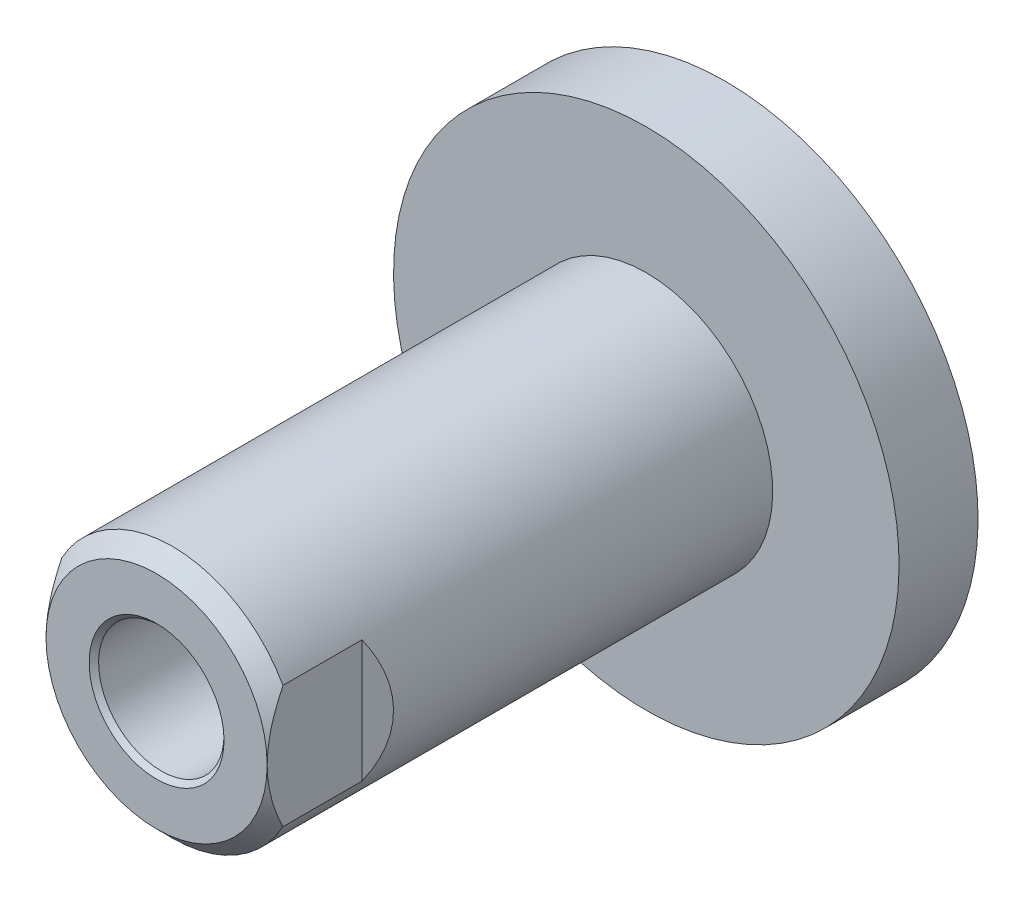
ISO-10303-21;
HEADER;
FILE_DESCRIPTION(('STEP AP214'),'2;1');
FILE_NAME('part.step','',(''),(''),'','','');
FILE_SCHEMA(('AUTOMOTIVE_DESIGN { 1 0 10303 214 1 1 1 1 }'));
ENDSEC;
DATA;
#1=APPLICATION_CONTEXT('core data for automotive mechanical design processes');
#2=APPLICATION_PROTOCOL_DEFINITION('international standard','automotive_design',2000,#1);
#3=PRODUCT_CONTEXT('',#1,'mechanical');
#4=PRODUCT('Part','Part','',(#3));
#5=PRODUCT_RELATED_PRODUCT_CATEGORY('part','',(#4));
#6=PRODUCT_DEFINITION_FORMATION('','',#4);
#7=PRODUCT_DEFINITION_CONTEXT('part definition',#1,'design');
#8=PRODUCT_DEFINITION('design','',#6,#7);
#9=PRODUCT_DEFINITION_SHAPE('','',#8);
#10=(LENGTH_UNIT() NAMED_UNIT(*) SI_UNIT(.MILLI.,.METRE.));
#11=(NAMED_UNIT(*) PLANE_ANGLE_UNIT() SI_UNIT($,.RADIAN.));
#12=(NAMED_UNIT(*) SI_UNIT($,.STERADIAN.) SOLID_ANGLE_UNIT());
#13=UNCERTAINTY_MEASURE_WITH_UNIT(LENGTH_MEASURE(1.E-05),#10,'distance_accuracy_value','');
#14=(GEOMETRIC_REPRESENTATION_CONTEXT(3) GLOBAL_UNCERTAINTY_ASSIGNED_CONTEXT((#13)) GLOBAL_UNIT_ASSIGNED_CONTEXT((#10,
#11,#12)) REPRESENTATION_CONTEXT('',''));
#15=CARTESIAN_POINT('',(0.,0.,0.));
#16=DIRECTION('',(0.,0.,1.));
#17=DIRECTION('',(1.,0.,0.));
#18=AXIS2_PLACEMENT_3D('',#15,#16,#17);
#19=CARTESIAN_POINT('',(0.,0.,23.));
#20=DIRECTION('',(0.,0.,1.));
#21=DIRECTION('',(0.,-1.,0.));
#22=AXIS2_PLACEMENT_3D('',#19,#20,#21);
#23=PLANE('',#22);
#24=CARTESIAN_POINT('',(0.,0.,23.));
#25=DIRECTION('',(0.,0.,1.));
#26=DIRECTION('',(0.,-1.,0.));
#27=AXIS2_PLACEMENT_3D('',#24,#25,#26);
#28=CIRCLE('',#27,3.97);
#29=CARTESIAN_POINT('',(0.,-3.97000000000006,23.));
#30=VERTEX_POINT('',#29);
#31=EDGE_CURVE('E21',#30,#30,#28,.T.);
#32=ORIENTED_EDGE('',*,*,#31,.T.);
#33=EDGE_LOOP('',(#32));
#34=FACE_BOUND('',#33,.T.);
#35=ADVANCED_FACE('F18',(#34),#23,.T.);
#36=CARTESIAN_POINT('',(0.,0.,23.));
#37=DIRECTION('',(0.,0.,1.));
#38=DIRECTION('',(0.,-1.,0.));
#39=AXIS2_PLACEMENT_3D('',#36,#37,#38);
#40=CYLINDRICAL_SURFACE('',#39,3.97);
#41=ORIENTED_EDGE('',*,*,#31,.F.);
#42=EDGE_LOOP('',(#41));
#43=FACE_BOUND('',#42,.T.);
#44=CARTESIAN_POINT('',(0.,0.,35.7000000000198));
#45=DIRECTION('',(0.,0.,1.));
#46=DIRECTION('',(1.,0.,0.));
#47=AXIS2_PLACEMENT_3D('',#44,#45,#46);
#48=CIRCLE('',#47,3.96999999998116);
#49=CARTESIAN_POINT('',(3.96999999998116,0.,35.7000000000198));
#50=VERTEX_POINT('',#49);
#51=EDGE_CURVE('E129',#50,#50,#48,.T.);
#52=ORIENTED_EDGE('',*,*,#51,.T.);
#53=EDGE_LOOP('',(#52));
#54=FACE_BOUND('',#53,.T.);
#55=ADVANCED_FACE('F232',(#43,#54),#40,.F.);
#56=CARTESIAN_POINT('',(0.,0.,36.0000000000582));
#57=DIRECTION('',(0.,0.,1.));
#58=DIRECTION('',(1.,0.,0.));
#59=AXIS2_PLACEMENT_3D('',#56,#57,#58);
#60=CONICAL_SURFACE('',#59,4.27000000001954,0.785398163397448);
#61=ORIENTED_EDGE('',*,*,#51,.F.);
#62=EDGE_LOOP('',(#61));
#63=FACE_BOUND('',#62,.T.);
#64=CARTESIAN_POINT('',(0.,0.,36.0000000000582));
#65=DIRECTION('',(0.,0.,1.));
#66=DIRECTION('',(1.,0.,0.));
#67=AXIS2_PLACEMENT_3D('',#64,#65,#66);
#68=CIRCLE('',#67,4.27000000001954);
#69=CARTESIAN_POINT('',(4.27000000001954,0.,36.0000000000582));
#70=VERTEX_POINT('',#69);
#71=EDGE_CURVE('E71',#70,#70,#68,.F.);
#72=ORIENTED_EDGE('',*,*,#71,.F.);
#73=EDGE_LOOP('',(#72));
#74=FACE_BOUND('',#73,.T.);
#75=ADVANCED_FACE('F227',(#63,#74),#60,.F.);
#76=CARTESIAN_POINT('',(0.,0.,36.));
#77=DIRECTION('',(0.,0.,1.));
#78=DIRECTION('',(0.,-1.,0.));
#79=AXIS2_PLACEMENT_3D('',#76,#77,#78);
#80=PLANE('',#79);
#81=CARTESIAN_POINT('',(0.,0.,35.9999999999445));
#82=DIRECTION('',(0.,0.,-1.));
#83=DIRECTION('',(-1.,0.,0.));
#84=AXIS2_PLACEMENT_3D('',#81,#82,#83);
#85=CIRCLE('',#84,7.000000000005);
#86=CARTESIAN_POINT('',(-7.0000000000025,0.,35.999999999947));
#87=VERTEX_POINT('',#86);
#88=CARTESIAN_POINT('',(7.0000000000025,0.,35.999999999947));
#89=VERTEX_POINT('',#88);
#90=EDGE_CURVE('E55',#87,#89,#85,.T.);
#91=ORIENTED_EDGE('',*,*,#90,.F.);
#92=CARTESIAN_POINT('',(0.,0.,35.9999999999445));
#93=DIRECTION('',(0.,0.,-1.));
#94=DIRECTION('',(-1.,0.,0.));
#95=AXIS2_PLACEMENT_3D('',#92,#93,#94);
#96=CIRCLE('',#95,7.000000000005);
#97=EDGE_CURVE('E62',#89,#87,#96,.T.);
#98=ORIENTED_EDGE('',*,*,#97,.F.);
#99=EDGE_LOOP('',(#91,#98));
#100=FACE_BOUND('',#99,.T.);
#101=ORIENTED_EDGE('',*,*,#71,.T.);
#102=EDGE_LOOP('',(#101));
#103=FACE_BOUND('',#102,.T.);
#104=ADVANCED_FACE('F85',(#100,#103),#80,.T.);
#105=CARTESIAN_POINT('',(0.,0.,34.9999999999113));
#106=DIRECTION('',(0.,0.,-1.));
#107=DIRECTION('',(-1.,0.,0.));
#108=AXIS2_PLACEMENT_3D('',#105,#106,#107);
#109=CONICAL_SURFACE('',#108,7.99999999998136,0.785398163369027);
#110=CARTESIAN_POINT('',(7.00000000002258,-3.87298334617018,34.9999999999229));
#111=CARTESIAN_POINT('',(7.00000000000832,-3.73806698883901,35.0653070851011));
#112=CARTESIAN_POINT('',(7.00000000000228,-3.60213206543072,35.1285128367506));
#113=CARTESIAN_POINT('',(6.99999999999772,-3.32804378738901,35.2501127896948));
#114=CARTESIAN_POINT('',(6.99999999999921,-3.18988928343521,35.3085043954999));
#115=CARTESIAN_POINT('',(7.0000000000016,-2.77056998576093,35.4760299007574));
#116=CARTESIAN_POINT('',(7.00000000000041,-2.48597423662735,35.576809700547));
#117=CARTESIAN_POINT('',(6.9999999999996,-1.91587318399986,35.747489678305));
#118=CARTESIAN_POINT('',(6.99999999999993,-1.63060403598947,35.8181565525033));
#119=CARTESIAN_POINT('',(7.00000000000004,-1.19849633042339,35.8995521238037));
#120=CARTESIAN_POINT('',(7.00000000000001,-1.05392230350616,35.9225712542843));
#121=CARTESIAN_POINT('',(6.99999999999999,-0.763672568750489,35.959934240698));
#122=CARTESIAN_POINT('',(7.,-0.617997201670231,35.974280677037));
#123=CARTESIAN_POINT('',(7.,-0.39361858739629,35.9893792300256));
#124=CARTESIAN_POINT('',(7.,-0.315119520849899,35.9933500116863));
#125=CARTESIAN_POINT('',(7.,-0.157749174233256,35.9986663831592));
#126=CARTESIAN_POINT('',(7.,-0.0788775728946304,36.0000024522742));
#127=CARTESIAN_POINT('',(7.,0.,35.9999999999495));
#128=B_SPLINE_CURVE_WITH_KNOTS('',3,(#110,#111,#112,#113,#114,#115,#116,#117,#118,#119,#120,
#121,#122,#123,#124,#125,#126,#127),.UNSPECIFIED.,.F.,.F.,(4,2,2,2,2,2,2,2,4),(0.,
0.449646435828888,0.899533729166914,1.80406503691855,2.68394566334976,3.1229141026453,
3.56175187032726,3.79751124506275,4.03412100107633),.UNSPECIFIED.);
#129=CARTESIAN_POINT('',(7.,-3.87298334618644,34.9999999999565));
#130=VERTEX_POINT('',#129);
#131=EDGE_CURVE('E68',#130,#89,#128,.T.);
#132=ORIENTED_EDGE('',*,*,#131,.T.);
#133=ORIENTED_EDGE('',*,*,#97,.T.);
#134=CARTESIAN_POINT('',(-7.,0.,35.9999999999495));
#135=CARTESIAN_POINT('',(-7.,-0.107485564999522,36.0000124763697));
#136=CARTESIAN_POINT('',(-7.,-0.214966878707483,35.9975246572284));
#137=CARTESIAN_POINT('',(-7.,-0.429687370649734,35.9876410915484));
#138=CARTESIAN_POINT('',(-7.,-0.536926584158774,35.9802461134674));
#139=CARTESIAN_POINT('',(-7.,-0.750779369921216,35.9606576631995));
#140=CARTESIAN_POINT('',(-7.,-0.857393700044826,35.9484724479857));
#141=CARTESIAN_POINT('',(-7.,-1.06998728716205,35.919478957683));
#142=CARTESIAN_POINT('',(-7.,-1.17596652687346,35.9026705573654));
#143=CARTESIAN_POINT('',(-7.,-1.48956425356986,35.8461907990338));
#144=CARTESIAN_POINT('',(-7.,-1.69606057694875,35.8001570553438));
#145=CARTESIAN_POINT('',(-7.,-2.10509003541976,35.6929912555384));
#146=CARTESIAN_POINT('',(-7.,-2.30762204307205,35.6318549697482));
#147=CARTESIAN_POINT('',(-7.,-2.62416262602529,35.5250915714674));
#148=CARTESIAN_POINT('',(-7.,-2.73963668219789,35.4837296498472));
#149=CARTESIAN_POINT('',(-7.,-2.96907795982693,35.3970963361359));
#150=CARTESIAN_POINT('',(-7.,-3.08304554606322,35.3518259112225));
#151=CARTESIAN_POINT('',(-7.,-3.31052645780854,35.25734038814));
#152=CARTESIAN_POINT('',(-7.,-3.42402653781661,35.2080935476885));
#153=CARTESIAN_POINT('',(-7.,-3.64958006836686,35.1063745702166));
#154=CARTESIAN_POINT('',(-7.,-3.76163345396354,35.0539022890036));
#155=CARTESIAN_POINT('',(-7.,-3.87298334616665,34.9999999999124));
#156=B_SPLINE_CURVE_WITH_KNOTS('',3,(#134,#135,#136,#137,#138,#139,#140,#141,#142,#143,#144,
#145,#146,#147,#148,#149,#150,#151,#152,#153,#154,#155),.UNSPECIFIED.,.F.,.F.,(4,2,2,2,2,2,2,2,
2,2,4),(0.,0.32242086339032,0.644791247799432,0.96660837903797,1.28843422822447,
1.92241990363746,2.55658333716694,2.9244936378832,3.29231315696484,3.66343214190586,
4.03456772972142),.UNSPECIFIED.);
#157=CARTESIAN_POINT('',(-7.,-3.87298334618644,34.9999999999565));
#158=VERTEX_POINT('',#157);
#159=EDGE_CURVE('E66',#87,#158,#156,.T.);
#160=ORIENTED_EDGE('',*,*,#159,.T.);
#161=CARTESIAN_POINT('',(0.,0.,35.));
#162=DIRECTION('',(0.,0.,-1.));
#163=DIRECTION('',(0.,1.,0.));
#164=AXIS2_PLACEMENT_3D('',#161,#162,#163);
#165=CIRCLE('',#164,8.);
#166=EDGE_CURVE('E132',#130,#158,#165,.T.);
#167=ORIENTED_EDGE('',*,*,#166,.F.);
#168=EDGE_LOOP('',(#132,#133,#160,#167));
#169=FACE_BOUND('',#168,.T.);
#170=ADVANCED_FACE('F64',(#169),#109,.T.);
#171=CARTESIAN_POINT('',(8.00000000000002,7.49999999999995,29.));
#172=DIRECTION('',(0.707106781186544,0.,0.707106781186551));
#173=DIRECTION('',(0.707106781186551,0.,-0.707106781186544));
#174=AXIS2_PLACEMENT_3D('',#171,#172,#173);
#175=PLANE('',#174);
#176=DIRECTION('',(0.,1.,0.));
#177=VECTOR('',#176,1.);
#178=CARTESIAN_POINT('',(7.,7.49999999999995,30.));
#179=LINE('',#178,#177);
#180=CARTESIAN_POINT('',(7.,3.87298334620737,30.));
#181=VERTEX_POINT('',#180);
#182=CARTESIAN_POINT('',(7.,-3.87298334620748,30.));
#183=VERTEX_POINT('',#182);
#184=EDGE_CURVE('E116',#181,#183,#179,.F.);
#185=ORIENTED_EDGE('',*,*,#184,.T.);
#186=CARTESIAN_POINT('',(0.,0.,36.9999999999999));
#187=DIRECTION('',(0.707106781186544,0.,0.707106781186551));
#188=DIRECTION('',(0.707106781186551,0.,-0.707106781186544));
#189=AXIS2_PLACEMENT_3D('',#186,#187,#188);
#190=ELLIPSE('',#189,11.3137084989847,8.);
#191=EDGE_CURVE('E117',#181,#183,#190,.F.);
#192=ORIENTED_EDGE('',*,*,#191,.F.);
#193=EDGE_LOOP('',(#185,#192));
#194=FACE_BOUND('',#193,.T.);
#195=ADVANCED_FACE('F152',(#194),#175,.T.);
#196=CARTESIAN_POINT('',(-8.00000000000002,7.49999999999995,29.));
#197=DIRECTION('',(0.707106781186544,0.,-0.707106781186551));
#198=DIRECTION('',(-0.707106781186551,0.,-0.707106781186544));
#199=AXIS2_PLACEMENT_3D('',#196,#197,#198);
#200=PLANE('',#199);
#201=DIRECTION('',(0.,1.,0.));
#202=VECTOR('',#201,1.);
#203=CARTESIAN_POINT('',(-7.,7.49999999999995,30.));
#204=LINE('',#203,#202);
#205=CARTESIAN_POINT('',(-7.,-3.87298334620746,30.));
#206=VERTEX_POINT('',#205);
#207=CARTESIAN_POINT('',(-7.,3.87298334620735,30.));
#208=VERTEX_POINT('',#207);
#209=EDGE_CURVE('E81',#206,#208,#204,.T.);
#210=ORIENTED_EDGE('',*,*,#209,.T.);
#211=CARTESIAN_POINT('',(0.,0.,36.9999999999999));
#212=DIRECTION('',(0.707106781186544,0.,-0.707106781186551));
#213=DIRECTION('',(-0.707106781186551,0.,-0.707106781186544));
#214=AXIS2_PLACEMENT_3D('',#211,#212,#213);
#215=ELLIPSE('',#214,11.3137084989847,8.);
#216=EDGE_CURVE('E119',#206,#208,#215,.T.);
#217=ORIENTED_EDGE('',*,*,#216,.F.);
#218=EDGE_LOOP('',(#210,#217));
#219=FACE_BOUND('',#218,.T.);
#220=ADVANCED_FACE('F157',(#219),#200,.F.);
#221=CARTESIAN_POINT('',(-7.,7.49999999999995,29.));
#222=DIRECTION('',(1.,0.,0.));
#223=DIRECTION('',(0.,0.,-1.));
#224=AXIS2_PLACEMENT_3D('',#221,#222,#223);
#225=PLANE('',#224);
#226=ORIENTED_EDGE('',*,*,#209,.F.);
#227=DIRECTION('',(0.,0.,-1.));
#228=VECTOR('',#227,1.);
#229=CARTESIAN_POINT('',(-7.,-3.87298334620748,58.6274169979695));
#230=LINE('',#229,#228);
#231=EDGE_CURVE('E80',#158,#206,#230,.T.);
#232=ORIENTED_EDGE('',*,*,#231,.F.);
#233=ORIENTED_EDGE('',*,*,#159,.F.);
#234=CARTESIAN_POINT('',(-7.,3.87298334617215,34.9999999999097));
#235=CARTESIAN_POINT('',(-7.,3.738066988844,35.0653070850943));
#236=CARTESIAN_POINT('',(-7.,3.60213206543705,35.1285128367464));
#237=CARTESIAN_POINT('',(-7.,3.32804378739654,35.2501127896927));
#238=CARTESIAN_POINT('',(-7.,3.1898892834426,35.3085043954972));
#239=CARTESIAN_POINT('',(-7.,2.77056998576847,35.4760299007538));
#240=CARTESIAN_POINT('',(-7.,2.48597423663563,35.5768097005439));
#241=CARTESIAN_POINT('',(-7.,1.91587318400945,35.7474896783026));
#242=CARTESIAN_POINT('',(-7.,1.63060403599966,35.818156552501));
#243=CARTESIAN_POINT('',(-7.,1.19849633043452,35.8995521238018));
#244=CARTESIAN_POINT('',(-7.,1.0539223035176,35.9225712542825));
#245=CARTESIAN_POINT('',(-7.,0.763672568762526,35.9599342406967));
#246=CARTESIAN_POINT('',(-7.,0.617997201682557,35.9742806770359));
#247=CARTESIAN_POINT('',(-7.,0.393618587406798,35.9893792300251));
#248=CARTESIAN_POINT('',(-7.,0.315119520858301,35.9933500116859));
#249=CARTESIAN_POINT('',(-7.,0.157749174237416,35.9986663831592));
#250=CARTESIAN_POINT('',(-7.,0.0788775728966554,36.0000024522742));
#251=CARTESIAN_POINT('',(-7.,0.,35.9999999999495));
#252=B_SPLINE_CURVE_WITH_KNOTS('',3,(#234,#235,#236,#237,#238,#239,#240,#241,#242,#243,#244,
#245,#246,#247,#248,#249,#250,#251),.UNSPECIFIED.,.F.,.F.,(4,2,2,2,2,2,2,2,4),(0.,
0.44964643582866,0.899533729166271,1.80406503691662,2.68394566334607,3.1229141026408,
3.56175187032196,3.79751124506379,4.03412100108377),.UNSPECIFIED.);
#253=CARTESIAN_POINT('',(-7.,3.87298334620736,34.9999999999463));
#254=VERTEX_POINT('',#253);
#255=EDGE_CURVE('E78',#254,#87,#252,.T.);
#256=ORIENTED_EDGE('',*,*,#255,.F.);
#257=DIRECTION('',(0.,0.,-1.));
#258=VECTOR('',#257,1.);
#259=CARTESIAN_POINT('',(-7.,3.87298334620736,58.6274169979695));
#260=LINE('',#259,#258);
#261=EDGE_CURVE('E122',#208,#254,#260,.F.);
#262=ORIENTED_EDGE('',*,*,#261,.F.);
#263=EDGE_LOOP('',(#226,#232,#233,#256,#262));
#264=FACE_BOUND('',#263,.T.);
#265=ADVANCED_FACE('F76',(#264),#225,.F.);
#266=CARTESIAN_POINT('',(0.,0.,34.9999999999113));
#267=DIRECTION('',(0.,0.,-1.));
#268=DIRECTION('',(-1.,0.,0.));
#269=AXIS2_PLACEMENT_3D('',#266,#267,#268);
#270=CONICAL_SURFACE('',#269,7.99999999998136,0.785398163369027);
#271=CARTESIAN_POINT('',(7.,0.,35.9999999999495));
#272=CARTESIAN_POINT('',(7.,0.10748556499941,36.0000124763697));
#273=CARTESIAN_POINT('',(7.,0.214966878707372,35.9975246572284));
#274=CARTESIAN_POINT('',(7.,0.429687370649623,35.9876410915484));
#275=CARTESIAN_POINT('',(7.,0.536926584158663,35.9802461134674));
#276=CARTESIAN_POINT('',(7.,0.750779369921105,35.9606576631995));
#277=CARTESIAN_POINT('',(7.,0.857393700044715,35.9484724479857));
#278=CARTESIAN_POINT('',(7.,1.06998728716194,35.919478957683));
#279=CARTESIAN_POINT('',(7.,1.17596652687335,35.9026705573654));
#280=CARTESIAN_POINT('',(7.,1.48956425356975,35.8461907990338));
#281=CARTESIAN_POINT('',(7.,1.69606057694864,35.8001570553438));
#282=CARTESIAN_POINT('',(7.,2.10509003541965,35.6929912555384));
#283=CARTESIAN_POINT('',(7.,2.30762204307194,35.6318549697482));
#284=CARTESIAN_POINT('',(7.,2.62416262602518,35.5250915714674));
#285=CARTESIAN_POINT('',(7.,2.73963668219778,35.4837296498472));
#286=CARTESIAN_POINT('',(7.,2.96907795982681,35.3970963361359));
#287=CARTESIAN_POINT('',(7.,3.08304554606311,35.3518259112225));
#288=CARTESIAN_POINT('',(7.,3.31052645780843,35.25734038814));
#289=CARTESIAN_POINT('',(7.,3.42402653781649,35.2080935476885));
#290=CARTESIAN_POINT('',(7.,3.64958006836675,35.1063745702166));
#291=CARTESIAN_POINT('',(7.,3.76163345396343,35.0539022890036));
#292=CARTESIAN_POINT('',(7.,3.87298334616653,34.9999999999124));
#293=B_SPLINE_CURVE_WITH_KNOTS('',3,(#271,#272,#273,#274,#275,#276,#277,#278,#279,#280,#281,
#282,#283,#284,#285,#286,#287,#288,#289,#290,#291,#292),.UNSPECIFIED.,.F.,.F.,(4,2,2,2,2,2,2,2,
2,2,4),(0.,0.32242086339032,0.644791247799432,0.96660837903797,1.28843422822447,
1.92241990363746,2.55658333716694,2.9244936378832,3.29231315696483,3.66343214190585,
4.03456772972141),.UNSPECIFIED.);
#294=CARTESIAN_POINT('',(7.,3.87298334618632,34.9999999999565));
#295=VERTEX_POINT('',#294);
#296=EDGE_CURVE('E88',#89,#295,#293,.T.);
#297=ORIENTED_EDGE('',*,*,#296,.T.);
#298=CARTESIAN_POINT('',(0.,0.,35.));
#299=DIRECTION('',(0.,0.,-1.));
#300=DIRECTION('',(0.,1.,0.));
#301=AXIS2_PLACEMENT_3D('',#298,#299,#300);
#302=CIRCLE('',#301,8.);
#303=EDGE_CURVE('E36',#254,#295,#302,.T.);
#304=ORIENTED_EDGE('',*,*,#303,.F.);
#305=ORIENTED_EDGE('',*,*,#255,.T.);
#306=ORIENTED_EDGE('',*,*,#90,.T.);
#307=EDGE_LOOP('',(#297,#304,#305,#306));
#308=FACE_BOUND('',#307,.T.);
#309=ADVANCED_FACE('F83',(#308),#270,.T.);
#310=CARTESIAN_POINT('',(7.,7.49999999999995,29.));
#311=DIRECTION('',(-1.,0.,0.));
#312=DIRECTION('',(0.,0.,1.));
#313=AXIS2_PLACEMENT_3D('',#310,#311,#312);
#314=PLANE('',#313);
#315=ORIENTED_EDGE('',*,*,#184,.F.);
#316=DIRECTION('',(0.,0.,-1.));
#317=VECTOR('',#316,1.);
#318=CARTESIAN_POINT('',(7.,3.87298334620736,58.6274169979695));
#319=LINE('',#318,#317);
#320=EDGE_CURVE('E126',#295,#181,#319,.T.);
#321=ORIENTED_EDGE('',*,*,#320,.F.);
#322=ORIENTED_EDGE('',*,*,#296,.F.);
#323=ORIENTED_EDGE('',*,*,#131,.F.);
#324=DIRECTION('',(0.,0.,-1.));
#325=VECTOR('',#324,1.);
#326=CARTESIAN_POINT('',(7.,-3.87298334620747,58.6274169979695));
#327=LINE('',#326,#325);
#328=EDGE_CURVE('E134',#183,#130,#327,.F.);
#329=ORIENTED_EDGE('',*,*,#328,.F.);
#330=EDGE_LOOP('',(#315,#321,#322,#323,#329));
#331=FACE_BOUND('',#330,.T.);
#332=ADVANCED_FACE('F108',(#331),#314,.F.);
#333=CARTESIAN_POINT('',(0.,0.,58.6274169979695));
#334=DIRECTION('',(0.,0.,-1.));
#335=DIRECTION('',(0.,1.,0.));
#336=AXIS2_PLACEMENT_3D('',#333,#334,#335);
#337=CYLINDRICAL_SURFACE('',#336,8.);
#338=CARTESIAN_POINT('',(0.,0.,5.));
#339=DIRECTION('',(0.,0.,-1.));
#340=DIRECTION('',(0.,1.,0.));
#341=AXIS2_PLACEMENT_3D('',#338,#339,#340);
#342=CIRCLE('',#341,8.);
#343=CARTESIAN_POINT('',(0.,7.99999999999994,5.));
#344=VERTEX_POINT('',#343);
#345=EDGE_CURVE('E123',#344,#344,#342,.T.);
#346=ORIENTED_EDGE('',*,*,#345,.F.);
#347=EDGE_LOOP('',(#346));
#348=FACE_BOUND('',#347,.T.);
#349=ORIENTED_EDGE('',*,*,#303,.T.);
#350=ORIENTED_EDGE('',*,*,#320,.T.);
#351=ORIENTED_EDGE('',*,*,#191,.T.);
#352=ORIENTED_EDGE('',*,*,#328,.T.);
#353=ORIENTED_EDGE('',*,*,#166,.T.);
#354=ORIENTED_EDGE('',*,*,#231,.T.);
#355=ORIENTED_EDGE('',*,*,#216,.T.);
#356=ORIENTED_EDGE('',*,*,#261,.T.);
#357=EDGE_LOOP('',(#349,#350,#351,#352,#353,#354,#355,#356));
#358=FACE_BOUND('',#357,.T.);
#359=ADVANCED_FACE('F147',(#348,#358),#337,.T.);
#360=CARTESIAN_POINT('',(0.,0.,5.));
#361=DIRECTION('',(0.,0.,1.));
#362=DIRECTION('',(0.,-1.,0.));
#363=AXIS2_PLACEMENT_3D('',#360,#361,#362);
#364=PLANE('',#363);
#365=CARTESIAN_POINT('',(0.,0.,5.));
#366=DIRECTION('',(0.,0.,-1.));
#367=DIRECTION('',(0.,1.,0.));
#368=AXIS2_PLACEMENT_3D('',#365,#366,#367);
#369=CIRCLE('',#368,16.);
#370=CARTESIAN_POINT('',(0.,16.,5.));
#371=VERTEX_POINT('',#370);
#372=EDGE_CURVE('E27',#371,#371,#369,.T.);
#373=ORIENTED_EDGE('',*,*,#372,.F.);
#374=EDGE_LOOP('',(#373));
#375=FACE_BOUND('',#374,.T.);
#376=ORIENTED_EDGE('',*,*,#345,.T.);
#377=EDGE_LOOP('',(#376));
#378=FACE_BOUND('',#377,.T.);
#379=ADVANCED_FACE('F173',(#375,#378),#364,.T.);
#380=CARTESIAN_POINT('',(0.,0.,5.));
#381=DIRECTION('',(0.,0.,-1.));
#382=DIRECTION('',(0.,1.,0.));
#383=AXIS2_PLACEMENT_3D('',#380,#381,#382);
#384=CYLINDRICAL_SURFACE('',#383,16.);
#385=ORIENTED_EDGE('',*,*,#372,.T.);
#386=EDGE_LOOP('',(#385));
#387=FACE_BOUND('',#386,.T.);
#388=CARTESIAN_POINT('',(0.,0.,0.));
#389=DIRECTION('',(0.,0.,-1.));
#390=DIRECTION('',(0.,1.,0.));
#391=AXIS2_PLACEMENT_3D('',#388,#389,#390);
#392=CIRCLE('',#391,16.);
#393=CARTESIAN_POINT('',(0.,16.,0.));
#394=VERTEX_POINT('',#393);
#395=EDGE_CURVE('E11',#394,#394,#392,.F.);
#396=ORIENTED_EDGE('',*,*,#395,.T.);
#397=EDGE_LOOP('',(#396));
#398=FACE_BOUND('',#397,.T.);
#399=ADVANCED_FACE('F167',(#387,#398),#384,.T.);
#400=CARTESIAN_POINT('',(0.,0.,0.));
#401=DIRECTION('',(0.,0.,1.));
#402=DIRECTION('',(0.,-1.,0.));
#403=AXIS2_PLACEMENT_3D('',#400,#401,#402);
#404=PLANE('',#403);
#405=ORIENTED_EDGE('',*,*,#395,.F.);
#406=EDGE_LOOP('',(#405));
#407=FACE_BOUND('',#406,.T.);
#408=ADVANCED_FACE('F165',(#407),#404,.F.);
#409=CLOSED_SHELL('',(#35,#55,#75,#104,#170,#195,#220,#265,#309,#332,#359,#379,#399,#408));
#410=MANIFOLD_SOLID_BREP('B1',#409);
#411=ADVANCED_BREP_SHAPE_REPRESENTATION('',(#18,#410),#14);
#412=SHAPE_DEFINITION_REPRESENTATION(#9,#411);
ENDSEC;
END-ISO-10303-21;
